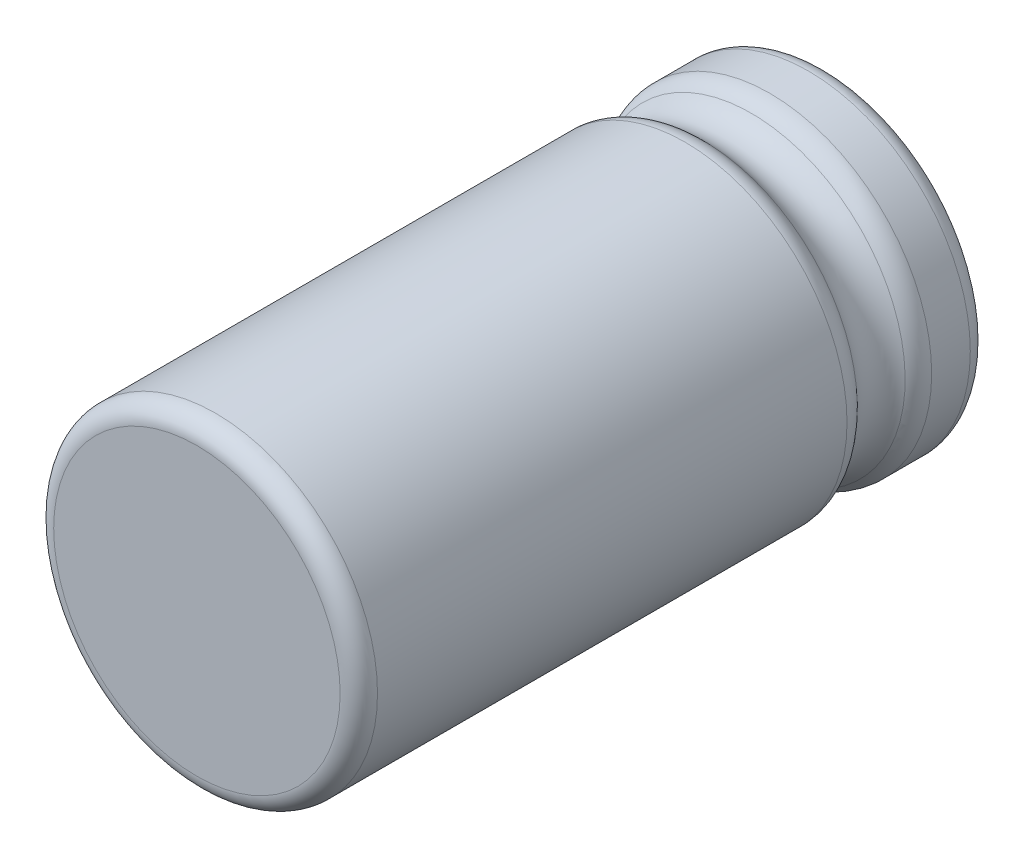
ISO-10303-21;
HEADER;
FILE_DESCRIPTION(('STEP AP214'),'2;1');
FILE_NAME('part.step','',(''),(''),'','','');
FILE_SCHEMA(('AUTOMOTIVE_DESIGN { 1 0 10303 214 1 1 1 1 }'));
ENDSEC;
DATA;
#1=APPLICATION_CONTEXT('core data for automotive mechanical design processes');
#2=APPLICATION_PROTOCOL_DEFINITION('international standard','automotive_design',2000,#1);
#3=PRODUCT_CONTEXT('',#1,'mechanical');
#4=PRODUCT('Part','Part','',(#3));
#5=PRODUCT_RELATED_PRODUCT_CATEGORY('part','',(#4));
#6=PRODUCT_DEFINITION_FORMATION('','',#4);
#7=PRODUCT_DEFINITION_CONTEXT('part definition',#1,'design');
#8=PRODUCT_DEFINITION('design','',#6,#7);
#9=PRODUCT_DEFINITION_SHAPE('','',#8);
#10=(LENGTH_UNIT() NAMED_UNIT(*) SI_UNIT(.MILLI.,.METRE.));
#11=(NAMED_UNIT(*) PLANE_ANGLE_UNIT() SI_UNIT($,.RADIAN.));
#12=(NAMED_UNIT(*) SI_UNIT($,.STERADIAN.) SOLID_ANGLE_UNIT());
#13=UNCERTAINTY_MEASURE_WITH_UNIT(LENGTH_MEASURE(1.E-05),#10,'distance_accuracy_value','');
#14=(GEOMETRIC_REPRESENTATION_CONTEXT(3) GLOBAL_UNCERTAINTY_ASSIGNED_CONTEXT((#13)) GLOBAL_UNIT_ASSIGNED_CONTEXT((#10,
#11,#12)) REPRESENTATION_CONTEXT('',''));
#15=CARTESIAN_POINT('',(0.,0.,0.));
#16=DIRECTION('',(0.,0.,1.));
#17=DIRECTION('',(1.,0.,0.));
#18=AXIS2_PLACEMENT_3D('',#15,#16,#17);
#19=CARTESIAN_POINT('',(16.38928586226,3.947980609798,-5.634484021814));
#20=DIRECTION('',(0.,-1.,0.));
#21=DIRECTION('',(0.,0.,-1.));
#22=AXIS2_PLACEMENT_3D('',#19,#20,#21);
#23=PLANE('',#22);
#24=CARTESIAN_POINT('',(16.38928586226,3.947980609798,-5.634484021814));
#25=DIRECTION('',(0.,1.,0.));
#26=DIRECTION('',(0.,0.,1.));
#27=AXIS2_PLACEMENT_3D('',#24,#25,#26);
#28=CIRCLE('',#27,0.25);
#29=CARTESIAN_POINT('',(16.38928586226,3.947980609798,-5.384484021814));
#30=VERTEX_POINT('',#29);
#31=EDGE_CURVE('E312',#30,#30,#28,.T.);
#32=ORIENTED_EDGE('',*,*,#31,.F.);
#33=EDGE_LOOP('',(#32));
#34=FACE_BOUND('',#33,.T.);
#35=ADVANCED_FACE('F17',(#34),#23,.T.);
#36=CARTESIAN_POINT('',(11.58928586226,3.947980609798,-5.634484021814));
#37=DIRECTION('',(0.,1.,0.));
#38=DIRECTION('',(0.,0.,1.));
#39=AXIS2_PLACEMENT_3D('',#36,#37,#38);
#40=PLANE('',#39);
#41=CARTESIAN_POINT('',(11.58928586226,3.947980609798,-5.634484021814));
#42=DIRECTION('',(0.,1.,0.));
#43=DIRECTION('',(0.,0.,1.));
#44=AXIS2_PLACEMENT_3D('',#41,#42,#43);
#45=CIRCLE('',#44,0.25);
#46=CARTESIAN_POINT('',(11.58928586226,3.947980609798,-5.384484021814));
#47=VERTEX_POINT('',#46);
#48=EDGE_CURVE('E314',#47,#47,#45,.T.);
#49=ORIENTED_EDGE('',*,*,#48,.F.);
#50=EDGE_LOOP('',(#49));
#51=FACE_BOUND('',#50,.T.);
#52=ADVANCED_FACE('F287',(#51),#40,.F.);
#53=CARTESIAN_POINT('',(16.38928586226,9.447980609798,-5.634484021814));
#54=DIRECTION('',(0.,1.,0.));
#55=DIRECTION('',(0.,0.,1.));
#56=AXIS2_PLACEMENT_3D('',#53,#54,#55);
#57=CYLINDRICAL_SURFACE('',#56,0.25);
#58=CARTESIAN_POINT('',(16.38928586226,9.447980609798,-5.634484021814));
#59=DIRECTION('',(0.,-1.,0.));
#60=DIRECTION('',(0.,0.,-1.));
#61=AXIS2_PLACEMENT_3D('',#58,#59,#60);
#62=CIRCLE('',#61,0.25);
#63=CARTESIAN_POINT('',(16.38928586226,9.447980609798,-5.884484021814));
#64=VERTEX_POINT('',#63);
#65=EDGE_CURVE('E317',#64,#64,#62,.F.);
#66=ORIENTED_EDGE('',*,*,#65,.F.);
#67=EDGE_LOOP('',(#66));
#68=FACE_BOUND('',#67,.T.);
#69=ORIENTED_EDGE('',*,*,#31,.T.);
#70=EDGE_LOOP('',(#69));
#71=FACE_BOUND('',#70,.T.);
#72=ADVANCED_FACE('F277',(#68,#71),#57,.T.);
#73=CARTESIAN_POINT('',(11.58928586226,9.447980609798,-5.634484021814));
#74=DIRECTION('',(0.,1.,0.));
#75=DIRECTION('',(0.,0.,1.));
#76=AXIS2_PLACEMENT_3D('',#73,#74,#75);
#77=CYLINDRICAL_SURFACE('',#76,0.25);
#78=CARTESIAN_POINT('',(11.58928586226,9.447980609798,-5.634484021814));
#79=DIRECTION('',(0.,-1.,0.));
#80=DIRECTION('',(0.,0.,-1.));
#81=AXIS2_PLACEMENT_3D('',#78,#79,#80);
#82=CIRCLE('',#81,0.25);
#83=CARTESIAN_POINT('',(11.58928586226,9.447980609798,-5.884484021814));
#84=VERTEX_POINT('',#83);
#85=EDGE_CURVE('E342',#84,#84,#82,.F.);
#86=ORIENTED_EDGE('',*,*,#85,.F.);
#87=EDGE_LOOP('',(#86));
#88=FACE_BOUND('',#87,.T.);
#89=ORIENTED_EDGE('',*,*,#48,.T.);
#90=EDGE_LOOP('',(#89));
#91=FACE_BOUND('',#90,.T.);
#92=ADVANCED_FACE('F267',(#88,#91),#77,.T.);
#93=CARTESIAN_POINT('',(16.38928586226,9.447980609798,-4.634484021814));
#94=DIRECTION('',(-1.,0.,0.));
#95=DIRECTION('',(0.,1.,0.));
#96=AXIS2_PLACEMENT_3D('',#93,#94,#95);
#97=TOROIDAL_SURFACE('',#96,0.999999999999999,0.25);
#98=CARTESIAN_POINT('',(16.38928586226,10.447980609798,-4.634484021814));
#99=DIRECTION('',(0.,0.,-1.));
#100=DIRECTION('',(0.,1.,0.));
#101=AXIS2_PLACEMENT_3D('',#98,#99,#100);
#102=CIRCLE('',#101,0.25);
#103=CARTESIAN_POINT('',(16.38928586226,10.697980609798,-4.634484021814));
#104=VERTEX_POINT('',#103);
#105=EDGE_CURVE('E345',#104,#104,#102,.F.);
#106=ORIENTED_EDGE('',*,*,#105,.F.);
#107=EDGE_LOOP('',(#106));
#108=FACE_BOUND('',#107,.T.);
#109=ORIENTED_EDGE('',*,*,#65,.T.);
#110=EDGE_LOOP('',(#109));
#111=FACE_BOUND('',#110,.T.);
#112=ADVANCED_FACE('F257',(#108,#111),#97,.T.);
#113=CARTESIAN_POINT('',(11.58928586226,9.447980609798,-4.634484021814));
#114=DIRECTION('',(-1.,0.,0.));
#115=DIRECTION('',(0.,1.,0.));
#116=AXIS2_PLACEMENT_3D('',#113,#114,#115);
#117=TOROIDAL_SURFACE('',#116,0.999999999999999,0.25);
#118=CARTESIAN_POINT('',(11.58928586226,10.447980609798,-4.634484021814));
#119=DIRECTION('',(0.,0.,-1.));
#120=DIRECTION('',(0.,1.,0.));
#121=AXIS2_PLACEMENT_3D('',#118,#119,#120);
#122=CIRCLE('',#121,0.25);
#123=CARTESIAN_POINT('',(11.58928586226,10.697980609798,-4.634484021814));
#124=VERTEX_POINT('',#123);
#125=EDGE_CURVE('E65',#124,#124,#122,.F.);
#126=ORIENTED_EDGE('',*,*,#125,.F.);
#127=EDGE_LOOP('',(#126));
#128=FACE_BOUND('',#127,.T.);
#129=ORIENTED_EDGE('',*,*,#85,.T.);
#130=EDGE_LOOP('',(#129));
#131=FACE_BOUND('',#130,.T.);
#132=ADVANCED_FACE('F247',(#128,#131),#117,.T.);
#133=CARTESIAN_POINT('',(16.38928586226,10.447980609798,-4.634484021814));
#134=DIRECTION('',(0.,0.,-1.));
#135=DIRECTION('',(0.,1.,0.));
#136=AXIS2_PLACEMENT_3D('',#133,#134,#135);
#137=CYLINDRICAL_SURFACE('',#136,0.25);
#138=CARTESIAN_POINT('',(16.38928586226,10.447980609798,-4.134484021814));
#139=DIRECTION('',(0.,0.,-1.));
#140=DIRECTION('',(0.,1.,0.));
#141=AXIS2_PLACEMENT_3D('',#138,#139,#140);
#142=CIRCLE('',#141,0.25);
#143=CARTESIAN_POINT('',(16.38928586226,10.697980609798,-4.134484021814));
#144=VERTEX_POINT('',#143);
#145=EDGE_CURVE('E335',#144,#144,#142,.F.);
#146=ORIENTED_EDGE('',*,*,#145,.F.);
#147=EDGE_LOOP('',(#146));
#148=FACE_BOUND('',#147,.T.);
#149=ORIENTED_EDGE('',*,*,#105,.T.);
#150=EDGE_LOOP('',(#149));
#151=FACE_BOUND('',#150,.T.);
#152=ADVANCED_FACE('F238',(#148,#151),#137,.T.);
#153=CARTESIAN_POINT('',(11.58928586226,10.447980609798,-4.634484021814));
#154=DIRECTION('',(0.,0.,-1.));
#155=DIRECTION('',(0.,1.,0.));
#156=AXIS2_PLACEMENT_3D('',#153,#154,#155);
#157=CYLINDRICAL_SURFACE('',#156,0.25);
#158=CARTESIAN_POINT('',(11.58928586226,10.447980609798,-4.134484021814));
#159=DIRECTION('',(0.,0.,-1.));
#160=DIRECTION('',(0.,1.,0.));
#161=AXIS2_PLACEMENT_3D('',#158,#159,#160);
#162=CIRCLE('',#161,0.25);
#163=CARTESIAN_POINT('',(11.58928586226,10.697980609798,-4.134484021814));
#164=VERTEX_POINT('',#163);
#165=EDGE_CURVE('E52',#164,#164,#162,.F.);
#166=ORIENTED_EDGE('',*,*,#165,.F.);
#167=EDGE_LOOP('',(#166));
#168=FACE_BOUND('',#167,.T.);
#169=ORIENTED_EDGE('',*,*,#125,.T.);
#170=EDGE_LOOP('',(#169));
#171=FACE_BOUND('',#170,.T.);
#172=ADVANCED_FACE('F229',(#168,#171),#157,.T.);
#173=CARTESIAN_POINT('',(13.98928586226,10.447980609798,-4.134484021814));
#174=DIRECTION('',(0.,0.,-1.));
#175=DIRECTION('',(0.,1.,0.));
#176=AXIS2_PLACEMENT_3D('',#173,#174,#175);
#177=PLANE('',#176);
#178=ORIENTED_EDGE('',*,*,#165,.T.);
#179=EDGE_LOOP('',(#178));
#180=FACE_BOUND('',#179,.T.);
#181=ORIENTED_EDGE('',*,*,#145,.T.);
#182=EDGE_LOOP('',(#181));
#183=FACE_BOUND('',#182,.T.);
#184=CARTESIAN_POINT('',(13.98928586226,10.447980609798,-4.134484021814));
#185=DIRECTION('',(0.,0.,1.));
#186=DIRECTION('',(0.,-1.,0.));
#187=AXIS2_PLACEMENT_3D('',#184,#185,#186);
#188=CIRCLE('',#187,5.75);
#189=CARTESIAN_POINT('',(13.98928586226,4.697980609798,-4.134484021814));
#190=VERTEX_POINT('',#189);
#191=CARTESIAN_POINT('',(13.98928586226,16.197980609798,-4.134484021814));
#192=VERTEX_POINT('',#191);
#193=EDGE_CURVE('E45',#190,#192,#188,.T.);
#194=ORIENTED_EDGE('',*,*,#193,.F.);
#195=CARTESIAN_POINT('',(13.98928586226,10.447980609798,-4.134484021814));
#196=DIRECTION('',(0.,0.,1.));
#197=DIRECTION('',(0.,1.,0.));
#198=AXIS2_PLACEMENT_3D('',#195,#196,#197);
#199=CIRCLE('',#198,5.75);
#200=EDGE_CURVE('E48',#192,#190,#199,.T.);
#201=ORIENTED_EDGE('',*,*,#200,.F.);
#202=EDGE_LOOP('',(#194,#201));
#203=FACE_BOUND('',#202,.T.);
#204=ADVANCED_FACE('F50',(#180,#183,#203),#177,.T.);
#205=CARTESIAN_POINT('',(13.98928586226,10.447980609798,-3.384484021814));
#206=DIRECTION('',(0.,0.,1.));
#207=DIRECTION('',(0.,-1.,0.));
#208=AXIS2_PLACEMENT_3D('',#205,#206,#207);
#209=TOROIDAL_SURFACE('',#208,5.75,0.75);
#210=CARTESIAN_POINT('',(13.98928586226,10.447980609798,-3.384484021814));
#211=DIRECTION('',(0.,0.,-1.));
#212=DIRECTION('',(0.,1.,0.));
#213=AXIS2_PLACEMENT_3D('',#210,#211,#212);
#214=CIRCLE('',#213,6.5);
#215=CARTESIAN_POINT('',(13.98928586226,16.947980609798,-3.384484021814));
#216=VERTEX_POINT('',#215);
#217=EDGE_CURVE('E57',#216,#216,#214,.F.);
#218=ORIENTED_EDGE('',*,*,#217,.F.);
#219=EDGE_LOOP('',(#218));
#220=FACE_BOUND('',#219,.T.);
#221=ORIENTED_EDGE('',*,*,#193,.T.);
#222=ORIENTED_EDGE('',*,*,#200,.T.);
#223=EDGE_LOOP('',(#221,#222));
#224=FACE_BOUND('',#223,.T.);
#225=ADVANCED_FACE('F56',(#220,#224),#209,.T.);
#226=CARTESIAN_POINT('',(13.98928586226,10.447980609798,21.165515978186));
#227=DIRECTION('',(0.,0.,-1.));
#228=DIRECTION('',(0.,1.,0.));
#229=AXIS2_PLACEMENT_3D('',#226,#227,#228);
#230=CYLINDRICAL_SURFACE('',#229,6.5);
#231=CARTESIAN_POINT('',(13.98928586226,10.447980609798,-1.833842478287));
#232=DIRECTION('',(0.,0.,1.));
#233=DIRECTION('',(0.,-1.,0.));
#234=AXIS2_PLACEMENT_3D('',#231,#232,#233);
#235=CIRCLE('',#234,6.5);
#236=CARTESIAN_POINT('',(13.98928586226,3.947980609798,-1.833842478287));
#237=VERTEX_POINT('',#236);
#238=EDGE_CURVE('E93',#237,#237,#235,.T.);
#239=ORIENTED_EDGE('',*,*,#238,.F.);
#240=EDGE_LOOP('',(#239));
#241=FACE_BOUND('',#240,.T.);
#242=ORIENTED_EDGE('',*,*,#217,.T.);
#243=EDGE_LOOP('',(#242));
#244=FACE_BOUND('',#243,.T.);
#245=ADVANCED_FACE('F76',(#241,#244),#230,.T.);
#246=CARTESIAN_POINT('',(13.98928586226,10.447980609798,-1.833842478287));
#247=DIRECTION('',(0.,0.,1.));
#248=DIRECTION('',(0.,-1.,0.));
#249=AXIS2_PLACEMENT_3D('',#246,#247,#248);
#250=TOROIDAL_SURFACE('',#249,5.5,1.);
#251=CARTESIAN_POINT('',(13.98928586226,10.447980609798,-1.09505932117778));
#252=DIRECTION('',(0.,0.,1.));
#253=DIRECTION('',(0.,-1.,0.));
#254=AXIS2_PLACEMENT_3D('',#251,#252,#253);
#255=CIRCLE('',#254,6.1739432073782);
#256=CARTESIAN_POINT('',(13.98928586226,4.2740374024198,-1.09505932117778));
#257=VERTEX_POINT('',#256);
#258=EDGE_CURVE('E96',#257,#257,#255,.F.);
#259=ORIENTED_EDGE('',*,*,#258,.T.);
#260=EDGE_LOOP('',(#259));
#261=FACE_BOUND('',#260,.T.);
#262=ORIENTED_EDGE('',*,*,#238,.T.);
#263=EDGE_LOOP('',(#262));
#264=FACE_BOUND('',#263,.T.);
#265=ADVANCED_FACE('F100',(#261,#264),#250,.T.);
#266=CARTESIAN_POINT('',(13.98928586226,10.447980609798,-0.134484021814));
#267=DIRECTION('',(0.,0.,1.));
#268=DIRECTION('',(0.,-1.,0.));
#269=AXIS2_PLACEMENT_3D('',#266,#267,#268);
#270=TOROIDAL_SURFACE('',#269,7.050212775725,1.300212775725);
#271=ORIENTED_EDGE('',*,*,#258,.F.);
#272=EDGE_LOOP('',(#271));
#273=FACE_BOUND('',#272,.T.);
#274=CARTESIAN_POINT('',(13.98928586226,10.447980609798,0.826091277550086));
#275=DIRECTION('',(0.,0.,1.));
#276=DIRECTION('',(0.,-1.,0.));
#277=AXIS2_PLACEMENT_3D('',#274,#275,#276);
#278=CIRCLE('',#277,6.17394320737892);
#279=CARTESIAN_POINT('',(13.98928586226,4.27403740241908,0.826091277550087));
#280=VERTEX_POINT('',#279);
#281=EDGE_CURVE('E137',#280,#280,#278,.T.);
#282=ORIENTED_EDGE('',*,*,#281,.F.);
#283=EDGE_LOOP('',(#282));
#284=FACE_BOUND('',#283,.T.);
#285=ADVANCED_FACE('F103',(#273,#284),#270,.F.);
#286=CARTESIAN_POINT('',(13.98928586226,10.447980609798,21.165515978186));
#287=DIRECTION('',(0.,0.,1.));
#288=DIRECTION('',(0.,-1.,0.));
#289=AXIS2_PLACEMENT_3D('',#286,#287,#288);
#290=PLANE('',#289);
#291=CARTESIAN_POINT('',(13.98928586226,10.447980609798,21.165515978186));
#292=DIRECTION('',(0.,0.,-1.));
#293=DIRECTION('',(0.,1.,0.));
#294=AXIS2_PLACEMENT_3D('',#291,#292,#293);
#295=CIRCLE('',#294,5.75);
#296=CARTESIAN_POINT('',(13.98928586226,16.197980609798,21.165515978186));
#297=VERTEX_POINT('',#296);
#298=CARTESIAN_POINT('',(13.98928586226,4.697980609798,21.165515978186));
#299=VERTEX_POINT('',#298);
#300=EDGE_CURVE('E140',#297,#299,#295,.T.);
#301=ORIENTED_EDGE('',*,*,#300,.F.);
#302=CARTESIAN_POINT('',(13.98928586226,10.447980609798,21.165515978186));
#303=DIRECTION('',(0.,0.,-1.));
#304=DIRECTION('',(0.,-1.,0.));
#305=AXIS2_PLACEMENT_3D('',#302,#303,#304);
#306=CIRCLE('',#305,5.75);
#307=EDGE_CURVE('E36',#299,#297,#306,.T.);
#308=ORIENTED_EDGE('',*,*,#307,.F.);
#309=EDGE_LOOP('',(#301,#308));
#310=FACE_BOUND('',#309,.T.);
#311=ADVANCED_FACE('F107',(#310),#290,.T.);
#312=CARTESIAN_POINT('',(13.98928586226,10.447980609798,1.564874434659));
#313=DIRECTION('',(0.,0.,1.));
#314=DIRECTION('',(0.,-1.,0.));
#315=AXIS2_PLACEMENT_3D('',#312,#313,#314);
#316=TOROIDAL_SURFACE('',#315,5.5,1.);
#317=CARTESIAN_POINT('',(13.98928586226,10.447980609798,1.564874434659));
#318=DIRECTION('',(0.,0.,-1.));
#319=DIRECTION('',(0.,1.,0.));
#320=AXIS2_PLACEMENT_3D('',#317,#318,#319);
#321=CIRCLE('',#320,6.5);
#322=CARTESIAN_POINT('',(13.98928586226,16.947980609798,1.564874434659));
#323=VERTEX_POINT('',#322);
#324=EDGE_CURVE('E28',#323,#323,#321,.F.);
#325=ORIENTED_EDGE('',*,*,#324,.F.);
#326=EDGE_LOOP('',(#325));
#327=FACE_BOUND('',#326,.T.);
#328=ORIENTED_EDGE('',*,*,#281,.T.);
#329=EDGE_LOOP('',(#328));
#330=FACE_BOUND('',#329,.T.);
#331=ADVANCED_FACE('F129',(#327,#330),#316,.T.);
#332=CARTESIAN_POINT('',(13.98928586226,10.447980609798,20.415515978186));
#333=DIRECTION('',(0.,0.,1.));
#334=DIRECTION('',(0.,-1.,0.));
#335=AXIS2_PLACEMENT_3D('',#332,#333,#334);
#336=TOROIDAL_SURFACE('',#335,5.75,0.75);
#337=ORIENTED_EDGE('',*,*,#307,.T.);
#338=ORIENTED_EDGE('',*,*,#300,.T.);
#339=EDGE_LOOP('',(#337,#338));
#340=FACE_BOUND('',#339,.T.);
#341=CARTESIAN_POINT('',(13.98928586226,10.447980609798,20.415515978186));
#342=DIRECTION('',(0.,0.,-1.));
#343=DIRECTION('',(0.,1.,0.));
#344=AXIS2_PLACEMENT_3D('',#341,#342,#343);
#345=CIRCLE('',#344,6.5);
#346=CARTESIAN_POINT('',(13.98928586226,16.947980609798,20.415515978186));
#347=VERTEX_POINT('',#346);
#348=EDGE_CURVE('E11',#347,#347,#345,.T.);
#349=ORIENTED_EDGE('',*,*,#348,.F.);
#350=EDGE_LOOP('',(#349));
#351=FACE_BOUND('',#350,.T.);
#352=ADVANCED_FACE('F118',(#340,#351),#336,.T.);
#353=CARTESIAN_POINT('',(13.98928586226,10.447980609798,21.165515978186));
#354=DIRECTION('',(0.,0.,-1.));
#355=DIRECTION('',(0.,1.,0.));
#356=AXIS2_PLACEMENT_3D('',#353,#354,#355);
#357=CYLINDRICAL_SURFACE('',#356,6.5);
#358=ORIENTED_EDGE('',*,*,#348,.T.);
#359=EDGE_LOOP('',(#358));
#360=FACE_BOUND('',#359,.T.);
#361=ORIENTED_EDGE('',*,*,#324,.T.);
#362=EDGE_LOOP('',(#361));
#363=FACE_BOUND('',#362,.T.);
#364=ADVANCED_FACE('F128',(#360,#363),#357,.T.);
#365=CLOSED_SHELL('',(#35,#52,#72,#92,#112,#132,#152,#172,#204,#225,#245,#265,#285,#311,#331,
#352,#364));
#366=MANIFOLD_SOLID_BREP('B1',#365);
#367=ADVANCED_BREP_SHAPE_REPRESENTATION('',(#18,#366),#14);
#368=SHAPE_DEFINITION_REPRESENTATION(#9,#367);
ENDSEC;
END-ISO-10303-21;
